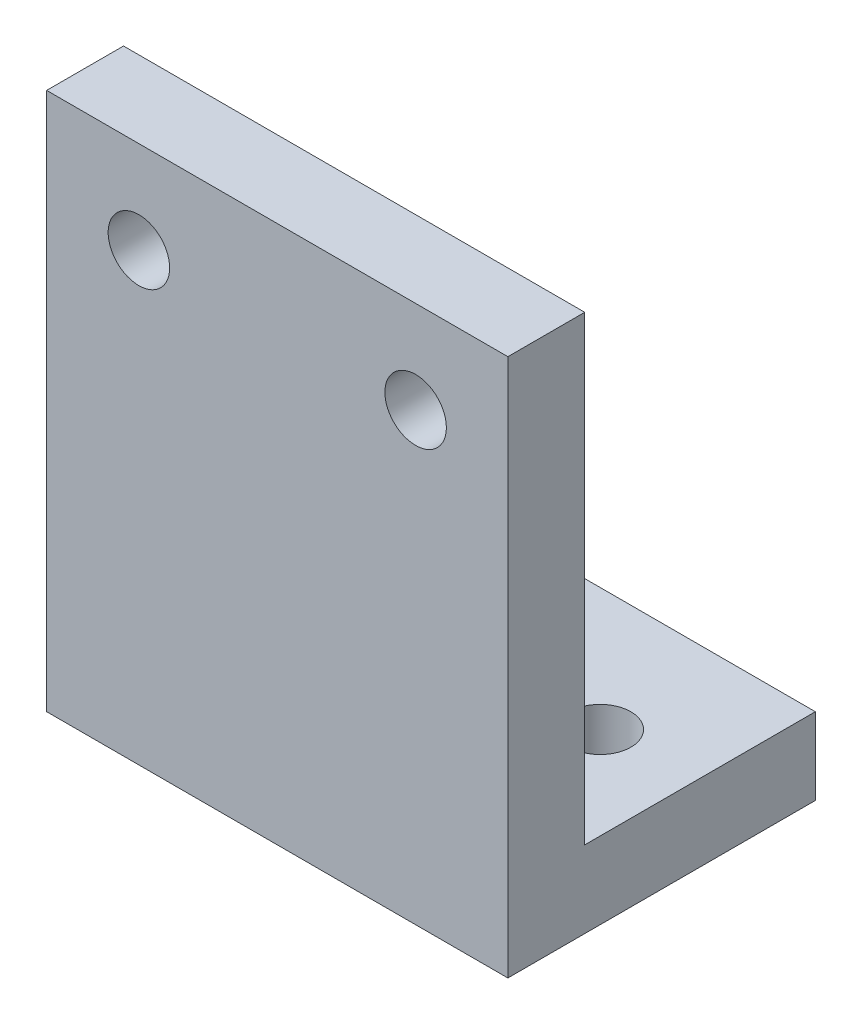
ISO-10303-21;
HEADER;
FILE_DESCRIPTION(('STEP AP214'),'2;1');
FILE_NAME('part.step','',(''),(''),'','','');
FILE_SCHEMA(('AUTOMOTIVE_DESIGN { 1 0 10303 214 1 1 1 1 }'));
ENDSEC;
DATA;
#1=APPLICATION_CONTEXT('core data for automotive mechanical design processes');
#2=APPLICATION_PROTOCOL_DEFINITION('international standard','automotive_design',2000,#1);
#3=PRODUCT_CONTEXT('',#1,'mechanical');
#4=PRODUCT('Part','Part','',(#3));
#5=PRODUCT_RELATED_PRODUCT_CATEGORY('part','',(#4));
#6=PRODUCT_DEFINITION_FORMATION('','',#4);
#7=PRODUCT_DEFINITION_CONTEXT('part definition',#1,'design');
#8=PRODUCT_DEFINITION('design','',#6,#7);
#9=PRODUCT_DEFINITION_SHAPE('','',#8);
#10=(LENGTH_UNIT() NAMED_UNIT(*) SI_UNIT(.MILLI.,.METRE.));
#11=(NAMED_UNIT(*) PLANE_ANGLE_UNIT() SI_UNIT($,.RADIAN.));
#12=(NAMED_UNIT(*) SI_UNIT($,.STERADIAN.) SOLID_ANGLE_UNIT());
#13=UNCERTAINTY_MEASURE_WITH_UNIT(LENGTH_MEASURE(1.E-05),#10,'distance_accuracy_value','');
#14=(GEOMETRIC_REPRESENTATION_CONTEXT(3) GLOBAL_UNCERTAINTY_ASSIGNED_CONTEXT((#13)) GLOBAL_UNIT_ASSIGNED_CONTEXT((#10,
#11,#12)) REPRESENTATION_CONTEXT('',''));
#15=CARTESIAN_POINT('',(0.,0.,0.));
#16=DIRECTION('',(0.,0.,1.));
#17=DIRECTION('',(1.,0.,0.));
#18=AXIS2_PLACEMENT_3D('',#15,#16,#17);
#19=CARTESIAN_POINT('',(0.,0.,5.));
#20=DIRECTION('',(0.,0.,-1.));
#21=DIRECTION('',(-1.,0.,0.));
#22=AXIS2_PLACEMENT_3D('',#19,#20,#21);
#23=PLANE('',#22);
#24=DIRECTION('',(0.,1.,0.));
#25=VECTOR('',#24,1.);
#26=CARTESIAN_POINT('',(15.,-15.,5.));
#27=LINE('',#26,#25);
#28=CARTESIAN_POINT('',(15.,-20.,5.));
#29=VERTEX_POINT('',#28);
#30=CARTESIAN_POINT('',(15.,15.,5.));
#31=VERTEX_POINT('',#30);
#32=EDGE_CURVE('E88',#29,#31,#27,.T.);
#33=ORIENTED_EDGE('',*,*,#32,.T.);
#34=DIRECTION('',(-1.,0.,0.));
#35=VECTOR('',#34,1.);
#36=CARTESIAN_POINT('',(-15.,15.,5.));
#37=LINE('',#36,#35);
#38=CARTESIAN_POINT('',(-15.,15.,5.));
#39=VERTEX_POINT('',#38);
#40=EDGE_CURVE('E50',#31,#39,#37,.T.);
#41=ORIENTED_EDGE('',*,*,#40,.T.);
#42=DIRECTION('',(0.,-1.,0.));
#43=VECTOR('',#42,1.);
#44=CARTESIAN_POINT('',(-15.,-15.,5.));
#45=LINE('',#44,#43);
#46=CARTESIAN_POINT('',(-15.,-20.,5.));
#47=VERTEX_POINT('',#46);
#48=EDGE_CURVE('E123',#39,#47,#45,.T.);
#49=ORIENTED_EDGE('',*,*,#48,.T.);
#50=DIRECTION('',(-1.,0.,0.));
#51=VECTOR('',#50,1.);
#52=CARTESIAN_POINT('',(-15.,-20.,5.));
#53=LINE('',#52,#51);
#54=EDGE_CURVE('E148',#29,#47,#53,.T.);
#55=ORIENTED_EDGE('',*,*,#54,.F.);
#56=EDGE_LOOP('',(#33,#41,#49,#55));
#57=FACE_BOUND('',#56,.T.);
#58=CARTESIAN_POINT('',(9.,9.,5.));
#59=DIRECTION('',(0.,0.,1.));
#60=DIRECTION('',(1.,0.,0.));
#61=AXIS2_PLACEMENT_3D('',#58,#59,#60);
#62=CIRCLE('',#61,2.);
#63=CARTESIAN_POINT('',(11.,9.,5.));
#64=VERTEX_POINT('',#63);
#65=EDGE_CURVE('E116',#64,#64,#62,.T.);
#66=ORIENTED_EDGE('',*,*,#65,.F.);
#67=EDGE_LOOP('',(#66));
#68=FACE_BOUND('',#67,.T.);
#69=CARTESIAN_POINT('',(-9.,9.,5.));
#70=DIRECTION('',(0.,0.,1.));
#71=DIRECTION('',(1.,0.,0.));
#72=AXIS2_PLACEMENT_3D('',#69,#70,#71);
#73=CIRCLE('',#72,2.);
#74=CARTESIAN_POINT('',(-7.,9.,5.));
#75=VERTEX_POINT('',#74);
#76=EDGE_CURVE('E110',#75,#75,#73,.T.);
#77=ORIENTED_EDGE('',*,*,#76,.F.);
#78=EDGE_LOOP('',(#77));
#79=FACE_BOUND('',#78,.T.);
#80=ADVANCED_FACE('F33',(#57,#68,#79),#23,.F.);
#81=CARTESIAN_POINT('',(0.,0.,0.));
#82=DIRECTION('',(0.,0.,-1.));
#83=DIRECTION('',(-1.,0.,0.));
#84=AXIS2_PLACEMENT_3D('',#81,#82,#83);
#85=PLANE('',#84);
#86=CARTESIAN_POINT('',(9.,9.,0.));
#87=DIRECTION('',(0.,0.,1.));
#88=DIRECTION('',(1.,0.,0.));
#89=AXIS2_PLACEMENT_3D('',#86,#87,#88);
#90=CIRCLE('',#89,2.);
#91=CARTESIAN_POINT('',(11.,9.,0.));
#92=VERTEX_POINT('',#91);
#93=EDGE_CURVE('E113',#92,#92,#90,.T.);
#94=ORIENTED_EDGE('',*,*,#93,.T.);
#95=EDGE_LOOP('',(#94));
#96=FACE_BOUND('',#95,.T.);
#97=DIRECTION('',(0.,1.,0.));
#98=VECTOR('',#97,1.);
#99=CARTESIAN_POINT('',(15.,-15.,0.));
#100=LINE('',#99,#98);
#101=CARTESIAN_POINT('',(15.,-15.,0.));
#102=VERTEX_POINT('',#101);
#103=CARTESIAN_POINT('',(15.,15.,0.));
#104=VERTEX_POINT('',#103);
#105=EDGE_CURVE('E84',#102,#104,#100,.T.);
#106=ORIENTED_EDGE('',*,*,#105,.F.);
#107=DIRECTION('',(1.,0.,0.));
#108=VECTOR('',#107,1.);
#109=CARTESIAN_POINT('',(-15.,-15.,0.));
#110=LINE('',#109,#108);
#111=CARTESIAN_POINT('',(-15.,-15.,0.));
#112=VERTEX_POINT('',#111);
#113=EDGE_CURVE('E77',#112,#102,#110,.T.);
#114=ORIENTED_EDGE('',*,*,#113,.F.);
#115=DIRECTION('',(0.,-1.,0.));
#116=VECTOR('',#115,1.);
#117=CARTESIAN_POINT('',(-15.,-15.,0.));
#118=LINE('',#117,#116);
#119=CARTESIAN_POINT('',(-15.,15.,0.));
#120=VERTEX_POINT('',#119);
#121=EDGE_CURVE('E67',#120,#112,#118,.T.);
#122=ORIENTED_EDGE('',*,*,#121,.F.);
#123=DIRECTION('',(-1.,0.,0.));
#124=VECTOR('',#123,1.);
#125=CARTESIAN_POINT('',(-15.,15.,0.));
#126=LINE('',#125,#124);
#127=EDGE_CURVE('E61',#104,#120,#126,.T.);
#128=ORIENTED_EDGE('',*,*,#127,.F.);
#129=EDGE_LOOP('',(#106,#114,#122,#128));
#130=FACE_BOUND('',#129,.T.);
#131=CARTESIAN_POINT('',(-9.,9.,0.));
#132=DIRECTION('',(0.,0.,1.));
#133=DIRECTION('',(1.,0.,0.));
#134=AXIS2_PLACEMENT_3D('',#131,#132,#133);
#135=CIRCLE('',#134,2.);
#136=CARTESIAN_POINT('',(-7.,9.,0.));
#137=VERTEX_POINT('',#136);
#138=EDGE_CURVE('E109',#137,#137,#135,.T.);
#139=ORIENTED_EDGE('',*,*,#138,.T.);
#140=EDGE_LOOP('',(#139));
#141=FACE_BOUND('',#140,.T.);
#142=ADVANCED_FACE('F81',(#96,#130,#141),#85,.T.);
#143=CARTESIAN_POINT('',(15.,-15.,5.));
#144=DIRECTION('',(-1.,0.,0.));
#145=DIRECTION('',(0.,0.,1.));
#146=AXIS2_PLACEMENT_3D('',#143,#144,#145);
#147=PLANE('',#146);
#148=ORIENTED_EDGE('',*,*,#105,.T.);
#149=DIRECTION('',(0.,0.,-1.));
#150=VECTOR('',#149,1.);
#151=CARTESIAN_POINT('',(15.,15.,5.));
#152=LINE('',#151,#150);
#153=EDGE_CURVE('E11',#31,#104,#152,.T.);
#154=ORIENTED_EDGE('',*,*,#153,.F.);
#155=ORIENTED_EDGE('',*,*,#32,.F.);
#156=DIRECTION('',(0.,0.,1.));
#157=VECTOR('',#156,1.);
#158=CARTESIAN_POINT('',(15.,-20.,-15.));
#159=LINE('',#158,#157);
#160=CARTESIAN_POINT('',(15.,-20.,-15.));
#161=VERTEX_POINT('',#160);
#162=EDGE_CURVE('E97',#161,#29,#159,.T.);
#163=ORIENTED_EDGE('',*,*,#162,.F.);
#164=DIRECTION('',(0.,1.,0.));
#165=VECTOR('',#164,1.);
#166=CARTESIAN_POINT('',(15.,-20.,-15.));
#167=LINE('',#166,#165);
#168=CARTESIAN_POINT('',(15.,-15.,-15.));
#169=VERTEX_POINT('',#168);
#170=EDGE_CURVE('E103',#161,#169,#167,.T.);
#171=ORIENTED_EDGE('',*,*,#170,.T.);
#172=DIRECTION('',(0.,0.,1.));
#173=VECTOR('',#172,1.);
#174=CARTESIAN_POINT('',(15.,-15.,-15.));
#175=LINE('',#174,#173);
#176=EDGE_CURVE('E95',#169,#102,#175,.T.);
#177=ORIENTED_EDGE('',*,*,#176,.T.);
#178=EDGE_LOOP('',(#148,#154,#155,#163,#171,#177));
#179=FACE_BOUND('',#178,.T.);
#180=ADVANCED_FACE('F35',(#179),#147,.F.);
#181=CARTESIAN_POINT('',(-15.,15.,5.));
#182=DIRECTION('',(0.,-1.,0.));
#183=DIRECTION('',(1.,0.,0.));
#184=AXIS2_PLACEMENT_3D('',#181,#182,#183);
#185=PLANE('',#184);
#186=ORIENTED_EDGE('',*,*,#127,.T.);
#187=DIRECTION('',(0.,0.,-1.));
#188=VECTOR('',#187,1.);
#189=CARTESIAN_POINT('',(-15.,15.,5.));
#190=LINE('',#189,#188);
#191=EDGE_CURVE('E42',#39,#120,#190,.T.);
#192=ORIENTED_EDGE('',*,*,#191,.F.);
#193=ORIENTED_EDGE('',*,*,#40,.F.);
#194=ORIENTED_EDGE('',*,*,#153,.T.);
#195=EDGE_LOOP('',(#186,#192,#193,#194));
#196=FACE_BOUND('',#195,.T.);
#197=ADVANCED_FACE('F199',(#196),#185,.F.);
#198=CARTESIAN_POINT('',(-15.,-15.,5.));
#199=DIRECTION('',(1.,0.,0.));
#200=DIRECTION('',(0.,1.,0.));
#201=AXIS2_PLACEMENT_3D('',#198,#199,#200);
#202=PLANE('',#201);
#203=ORIENTED_EDGE('',*,*,#121,.T.);
#204=DIRECTION('',(0.,0.,-1.));
#205=VECTOR('',#204,1.);
#206=CARTESIAN_POINT('',(-15.,-15.,-15.));
#207=LINE('',#206,#205);
#208=CARTESIAN_POINT('',(-15.,-15.,-15.));
#209=VERTEX_POINT('',#208);
#210=EDGE_CURVE('E73',#112,#209,#207,.T.);
#211=ORIENTED_EDGE('',*,*,#210,.T.);
#212=DIRECTION('',(0.,1.,0.));
#213=VECTOR('',#212,1.);
#214=CARTESIAN_POINT('',(-15.,-20.,-15.));
#215=LINE('',#214,#213);
#216=CARTESIAN_POINT('',(-15.,-20.,-15.));
#217=VERTEX_POINT('',#216);
#218=EDGE_CURVE('E106',#217,#209,#215,.T.);
#219=ORIENTED_EDGE('',*,*,#218,.F.);
#220=DIRECTION('',(0.,0.,-1.));
#221=VECTOR('',#220,1.);
#222=CARTESIAN_POINT('',(-15.,-20.,-15.));
#223=LINE('',#222,#221);
#224=EDGE_CURVE('E154',#47,#217,#223,.T.);
#225=ORIENTED_EDGE('',*,*,#224,.F.);
#226=ORIENTED_EDGE('',*,*,#48,.F.);
#227=ORIENTED_EDGE('',*,*,#191,.T.);
#228=EDGE_LOOP('',(#203,#211,#219,#225,#226,#227));
#229=FACE_BOUND('',#228,.T.);
#230=ADVANCED_FACE('F69',(#229),#202,.F.);
#231=CARTESIAN_POINT('',(9.,9.,5.));
#232=DIRECTION('',(0.,0.,-1.));
#233=DIRECTION('',(-1.,0.,0.));
#234=AXIS2_PLACEMENT_3D('',#231,#232,#233);
#235=CYLINDRICAL_SURFACE('',#234,2.);
#236=ORIENTED_EDGE('',*,*,#65,.T.);
#237=EDGE_LOOP('',(#236));
#238=FACE_BOUND('',#237,.T.);
#239=ORIENTED_EDGE('',*,*,#93,.F.);
#240=EDGE_LOOP('',(#239));
#241=FACE_BOUND('',#240,.T.);
#242=ADVANCED_FACE('F185',(#238,#241),#235,.F.);
#243=CARTESIAN_POINT('',(-9.,9.,5.));
#244=DIRECTION('',(0.,0.,-1.));
#245=DIRECTION('',(-1.,0.,0.));
#246=AXIS2_PLACEMENT_3D('',#243,#244,#245);
#247=CYLINDRICAL_SURFACE('',#246,2.);
#248=ORIENTED_EDGE('',*,*,#76,.T.);
#249=EDGE_LOOP('',(#248));
#250=FACE_BOUND('',#249,.T.);
#251=ORIENTED_EDGE('',*,*,#138,.F.);
#252=EDGE_LOOP('',(#251));
#253=FACE_BOUND('',#252,.T.);
#254=ADVANCED_FACE('F176',(#250,#253),#247,.F.);
#255=CARTESIAN_POINT('',(0.,-20.,0.));
#256=DIRECTION('',(0.,1.,0.));
#257=DIRECTION('',(0.,0.,1.));
#258=AXIS2_PLACEMENT_3D('',#255,#256,#257);
#259=PLANE('',#258);
#260=ORIENTED_EDGE('',*,*,#162,.T.);
#261=ORIENTED_EDGE('',*,*,#54,.T.);
#262=ORIENTED_EDGE('',*,*,#224,.T.);
#263=DIRECTION('',(1.,0.,0.));
#264=VECTOR('',#263,1.);
#265=CARTESIAN_POINT('',(-15.,-20.,-15.));
#266=LINE('',#265,#264);
#267=EDGE_CURVE('E107',#217,#161,#266,.T.);
#268=ORIENTED_EDGE('',*,*,#267,.T.);
#269=EDGE_LOOP('',(#260,#261,#262,#268));
#270=FACE_BOUND('',#269,.T.);
#271=CARTESIAN_POINT('',(-9.,-20.,-7.));
#272=DIRECTION('',(0.,-1.,0.));
#273=DIRECTION('',(0.,0.,-1.));
#274=AXIS2_PLACEMENT_3D('',#271,#272,#273);
#275=CIRCLE('',#274,2.);
#276=CARTESIAN_POINT('',(-9.,-20.,-9.));
#277=VERTEX_POINT('',#276);
#278=EDGE_CURVE('E99',#277,#277,#275,.T.);
#279=ORIENTED_EDGE('',*,*,#278,.F.);
#280=EDGE_LOOP('',(#279));
#281=FACE_BOUND('',#280,.T.);
#282=CARTESIAN_POINT('',(9.,-20.,-7.));
#283=DIRECTION('',(0.,-1.,0.));
#284=DIRECTION('',(0.,0.,1.));
#285=AXIS2_PLACEMENT_3D('',#282,#283,#284);
#286=CIRCLE('',#285,2.);
#287=CARTESIAN_POINT('',(9.,-20.,-5.));
#288=VERTEX_POINT('',#287);
#289=EDGE_CURVE('E163',#288,#288,#286,.T.);
#290=ORIENTED_EDGE('',*,*,#289,.F.);
#291=EDGE_LOOP('',(#290));
#292=FACE_BOUND('',#291,.T.);
#293=ADVANCED_FACE('F152',(#270,#281,#292),#259,.F.);
#294=CARTESIAN_POINT('',(0.,-15.,0.));
#295=DIRECTION('',(0.,1.,0.));
#296=DIRECTION('',(0.,0.,1.));
#297=AXIS2_PLACEMENT_3D('',#294,#295,#296);
#298=PLANE('',#297);
#299=CARTESIAN_POINT('',(-9.,-15.,-7.));
#300=DIRECTION('',(0.,-1.,0.));
#301=DIRECTION('',(0.,0.,-1.));
#302=AXIS2_PLACEMENT_3D('',#299,#300,#301);
#303=CIRCLE('',#302,2.);
#304=CARTESIAN_POINT('',(-9.,-15.,-9.));
#305=VERTEX_POINT('',#304);
#306=EDGE_CURVE('E160',#305,#305,#303,.T.);
#307=ORIENTED_EDGE('',*,*,#306,.T.);
#308=EDGE_LOOP('',(#307));
#309=FACE_BOUND('',#308,.T.);
#310=ORIENTED_EDGE('',*,*,#210,.F.);
#311=ORIENTED_EDGE('',*,*,#113,.T.);
#312=ORIENTED_EDGE('',*,*,#176,.F.);
#313=DIRECTION('',(1.,0.,0.));
#314=VECTOR('',#313,1.);
#315=CARTESIAN_POINT('',(-15.,-15.,-15.));
#316=LINE('',#315,#314);
#317=EDGE_CURVE('E94',#209,#169,#316,.T.);
#318=ORIENTED_EDGE('',*,*,#317,.F.);
#319=EDGE_LOOP('',(#310,#311,#312,#318));
#320=FACE_BOUND('',#319,.T.);
#321=CARTESIAN_POINT('',(9.,-15.,-7.));
#322=DIRECTION('',(0.,-1.,0.));
#323=DIRECTION('',(0.,0.,1.));
#324=AXIS2_PLACEMENT_3D('',#321,#322,#323);
#325=CIRCLE('',#324,2.);
#326=CARTESIAN_POINT('',(9.,-15.,-5.));
#327=VERTEX_POINT('',#326);
#328=EDGE_CURVE('E166',#327,#327,#325,.T.);
#329=ORIENTED_EDGE('',*,*,#328,.T.);
#330=EDGE_LOOP('',(#329));
#331=FACE_BOUND('',#330,.T.);
#332=ADVANCED_FACE('F91',(#309,#320,#331),#298,.T.);
#333=CARTESIAN_POINT('',(-15.,-20.,-15.));
#334=DIRECTION('',(0.,0.,1.));
#335=DIRECTION('',(1.,0.,0.));
#336=AXIS2_PLACEMENT_3D('',#333,#334,#335);
#337=PLANE('',#336);
#338=ORIENTED_EDGE('',*,*,#317,.T.);
#339=ORIENTED_EDGE('',*,*,#170,.F.);
#340=ORIENTED_EDGE('',*,*,#267,.F.);
#341=ORIENTED_EDGE('',*,*,#218,.T.);
#342=EDGE_LOOP('',(#338,#339,#340,#341));
#343=FACE_BOUND('',#342,.T.);
#344=ADVANCED_FACE('F182',(#343),#337,.F.);
#345=CARTESIAN_POINT('',(-9.,-20.,-7.));
#346=DIRECTION('',(0.,1.,0.));
#347=DIRECTION('',(0.,0.,1.));
#348=AXIS2_PLACEMENT_3D('',#345,#346,#347);
#349=CYLINDRICAL_SURFACE('',#348,2.);
#350=ORIENTED_EDGE('',*,*,#278,.T.);
#351=EDGE_LOOP('',(#350));
#352=FACE_BOUND('',#351,.T.);
#353=ORIENTED_EDGE('',*,*,#306,.F.);
#354=EDGE_LOOP('',(#353));
#355=FACE_BOUND('',#354,.T.);
#356=ADVANCED_FACE('F265',(#352,#355),#349,.F.);
#357=CARTESIAN_POINT('',(9.,-20.,-7.));
#358=DIRECTION('',(0.,1.,0.));
#359=DIRECTION('',(0.,0.,1.));
#360=AXIS2_PLACEMENT_3D('',#357,#358,#359);
#361=CYLINDRICAL_SURFACE('',#360,2.);
#362=ORIENTED_EDGE('',*,*,#289,.T.);
#363=EDGE_LOOP('',(#362));
#364=FACE_BOUND('',#363,.T.);
#365=ORIENTED_EDGE('',*,*,#328,.F.);
#366=EDGE_LOOP('',(#365));
#367=FACE_BOUND('',#366,.T.);
#368=ADVANCED_FACE('F172',(#364,#367),#361,.F.);
#369=CLOSED_SHELL('',(#80,#142,#180,#197,#230,#242,#254,#293,#332,#344,#356,#368));
#370=MANIFOLD_SOLID_BREP('B2',#369);
#371=ADVANCED_BREP_SHAPE_REPRESENTATION('',(#18,#370),#14);
#372=SHAPE_DEFINITION_REPRESENTATION(#9,#371);
ENDSEC;
END-ISO-10303-21;
